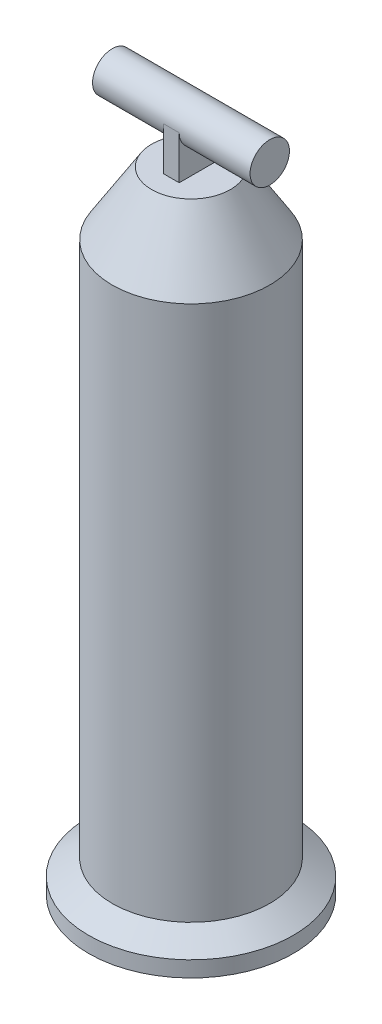
ISO-10303-21;
HEADER;
FILE_DESCRIPTION(('STEP AP214'),'2;1');
FILE_NAME('part.step','',(''),(''),'','','');
FILE_SCHEMA(('AUTOMOTIVE_DESIGN { 1 0 10303 214 1 1 1 1 }'));
ENDSEC;
DATA;
#1=APPLICATION_CONTEXT('core data for automotive mechanical design processes');
#2=APPLICATION_PROTOCOL_DEFINITION('international standard','automotive_design',2000,#1);
#3=PRODUCT_CONTEXT('',#1,'mechanical');
#4=PRODUCT('Part','Part','',(#3));
#5=PRODUCT_RELATED_PRODUCT_CATEGORY('part','',(#4));
#6=PRODUCT_DEFINITION_FORMATION('','',#4);
#7=PRODUCT_DEFINITION_CONTEXT('part definition',#1,'design');
#8=PRODUCT_DEFINITION('design','',#6,#7);
#9=PRODUCT_DEFINITION_SHAPE('','',#8);
#10=(LENGTH_UNIT() NAMED_UNIT(*) SI_UNIT(.MILLI.,.METRE.));
#11=(NAMED_UNIT(*) PLANE_ANGLE_UNIT() SI_UNIT($,.RADIAN.));
#12=(NAMED_UNIT(*) SI_UNIT($,.STERADIAN.) SOLID_ANGLE_UNIT());
#13=UNCERTAINTY_MEASURE_WITH_UNIT(LENGTH_MEASURE(1.E-05),#10,'distance_accuracy_value','');
#14=(GEOMETRIC_REPRESENTATION_CONTEXT(3) GLOBAL_UNCERTAINTY_ASSIGNED_CONTEXT((#13)) GLOBAL_UNIT_ASSIGNED_CONTEXT((#10,
#11,#12)) REPRESENTATION_CONTEXT('',''));
#15=CARTESIAN_POINT('',(0.,0.,0.));
#16=DIRECTION('',(0.,0.,1.));
#17=DIRECTION('',(1.,0.,0.));
#18=AXIS2_PLACEMENT_3D('',#15,#16,#17);
#19=CARTESIAN_POINT('',(-1.,88.,2.5));
#20=DIRECTION('',(1.,0.,0.));
#21=DIRECTION('',(0.,0.,-1.));
#22=AXIS2_PLACEMENT_3D('',#19,#20,#21);
#23=PLANE('',#22);
#24=DIRECTION('',(0.,-1.,0.));
#25=VECTOR('',#24,1.);
#26=CARTESIAN_POINT('',(-1.,88.,2.5));
#27=LINE('',#26,#25);
#28=CARTESIAN_POINT('',(-1.,85.5,2.5));
#29=VERTEX_POINT('',#28);
#30=CARTESIAN_POINT('',(-1.,80.,2.5));
#31=VERTEX_POINT('',#30);
#32=EDGE_CURVE('E98',#29,#31,#27,.T.);
#33=ORIENTED_EDGE('',*,*,#32,.F.);
#34=CARTESIAN_POINT('',(-1.,85.5,0.));
#35=DIRECTION('',(1.,0.,0.));
#36=DIRECTION('',(0.,0.,-1.));
#37=AXIS2_PLACEMENT_3D('',#34,#35,#36);
#38=CIRCLE('',#37,2.5);
#39=CARTESIAN_POINT('',(-1.,85.5,-2.5));
#40=VERTEX_POINT('',#39);
#41=EDGE_CURVE('E85',#29,#40,#38,.T.);
#42=ORIENTED_EDGE('',*,*,#41,.T.);
#43=DIRECTION('',(0.,-1.,0.));
#44=VECTOR('',#43,1.);
#45=CARTESIAN_POINT('',(-1.,88.,-2.5));
#46=LINE('',#45,#44);
#47=CARTESIAN_POINT('',(-1.,80.,-2.5));
#48=VERTEX_POINT('',#47);
#49=EDGE_CURVE('E65',#40,#48,#46,.T.);
#50=ORIENTED_EDGE('',*,*,#49,.T.);
#51=DIRECTION('',(0.,0.,1.));
#52=VECTOR('',#51,1.);
#53=CARTESIAN_POINT('',(-1.,80.,2.5));
#54=LINE('',#53,#52);
#55=EDGE_CURVE('E102',#48,#31,#54,.T.);
#56=ORIENTED_EDGE('',*,*,#55,.T.);
#57=EDGE_LOOP('',(#33,#42,#50,#56));
#58=FACE_BOUND('',#57,.T.);
#59=ADVANCED_FACE('F42',(#58),#23,.F.);
#60=CARTESIAN_POINT('',(1.,88.,-2.5));
#61=DIRECTION('',(-1.,0.,0.));
#62=DIRECTION('',(0.,0.,1.));
#63=AXIS2_PLACEMENT_3D('',#60,#61,#62);
#64=PLANE('',#63);
#65=DIRECTION('',(0.,-1.,0.));
#66=VECTOR('',#65,1.);
#67=CARTESIAN_POINT('',(1.,88.,-2.5));
#68=LINE('',#67,#66);
#69=CARTESIAN_POINT('',(1.,85.5,-2.5));
#70=VERTEX_POINT('',#69);
#71=CARTESIAN_POINT('',(1.,80.,-2.5));
#72=VERTEX_POINT('',#71);
#73=EDGE_CURVE('E57',#70,#72,#68,.T.);
#74=ORIENTED_EDGE('',*,*,#73,.F.);
#75=CARTESIAN_POINT('',(1.,85.5,0.));
#76=DIRECTION('',(-1.,0.,0.));
#77=DIRECTION('',(0.,0.,1.));
#78=AXIS2_PLACEMENT_3D('',#75,#76,#77);
#79=CIRCLE('',#78,2.5);
#80=CARTESIAN_POINT('',(1.,85.5,2.5));
#81=VERTEX_POINT('',#80);
#82=EDGE_CURVE('E93',#70,#81,#79,.T.);
#83=ORIENTED_EDGE('',*,*,#82,.T.);
#84=DIRECTION('',(0.,-1.,0.));
#85=VECTOR('',#84,1.);
#86=CARTESIAN_POINT('',(1.,88.,2.5));
#87=LINE('',#86,#85);
#88=CARTESIAN_POINT('',(1.,80.,2.5));
#89=VERTEX_POINT('',#88);
#90=EDGE_CURVE('E99',#81,#89,#87,.T.);
#91=ORIENTED_EDGE('',*,*,#90,.T.);
#92=DIRECTION('',(0.,0.,-1.));
#93=VECTOR('',#92,1.);
#94=CARTESIAN_POINT('',(1.,80.,-2.5));
#95=LINE('',#94,#93);
#96=EDGE_CURVE('E311',#89,#72,#95,.T.);
#97=ORIENTED_EDGE('',*,*,#96,.T.);
#98=EDGE_LOOP('',(#74,#83,#91,#97));
#99=FACE_BOUND('',#98,.T.);
#100=ADVANCED_FACE('F141',(#99),#64,.F.);
#101=CARTESIAN_POINT('',(-1.,88.,-2.5));
#102=DIRECTION('',(0.,0.,1.));
#103=DIRECTION('',(1.,0.,0.));
#104=AXIS2_PLACEMENT_3D('',#101,#102,#103);
#105=PLANE('',#104);
#106=DIRECTION('',(-1.,0.,0.));
#107=VECTOR('',#106,1.);
#108=CARTESIAN_POINT('',(13.,85.5,-2.5));
#109=LINE('',#108,#107);
#110=EDGE_CURVE('E91',#70,#40,#109,.T.);
#111=ORIENTED_EDGE('',*,*,#110,.F.);
#112=ORIENTED_EDGE('',*,*,#73,.T.);
#113=DIRECTION('',(-1.,0.,0.));
#114=VECTOR('',#113,1.);
#115=CARTESIAN_POINT('',(-1.,80.,-2.5));
#116=LINE('',#115,#114);
#117=EDGE_CURVE('E313',#72,#48,#116,.T.);
#118=ORIENTED_EDGE('',*,*,#117,.T.);
#119=ORIENTED_EDGE('',*,*,#49,.F.);
#120=EDGE_LOOP('',(#111,#112,#118,#119));
#121=FACE_BOUND('',#120,.T.);
#122=ADVANCED_FACE('F146',(#121),#105,.F.);
#123=CARTESIAN_POINT('',(0.,80.,5.));
#124=DIRECTION('',(0.,1.,0.));
#125=DIRECTION('',(0.,0.,1.));
#126=AXIS2_PLACEMENT_3D('',#123,#124,#125);
#127=PLANE('',#126);
#128=CARTESIAN_POINT('',(0.,80.,0.));
#129=DIRECTION('',(0.,1.,0.));
#130=DIRECTION('',(0.,0.,1.));
#131=AXIS2_PLACEMENT_3D('',#128,#129,#130);
#132=CIRCLE('',#131,5.);
#133=CARTESIAN_POINT('',(0.,80.,5.));
#134=VERTEX_POINT('',#133);
#135=EDGE_CURVE('E114',#134,#134,#132,.T.);
#136=ORIENTED_EDGE('',*,*,#135,.T.);
#137=EDGE_LOOP('',(#136));
#138=FACE_BOUND('',#137,.T.);
#139=DIRECTION('',(1.,0.,0.));
#140=VECTOR('',#139,1.);
#141=CARTESIAN_POINT('',(1.,80.,2.5));
#142=LINE('',#141,#140);
#143=EDGE_CURVE('E309',#31,#89,#142,.T.);
#144=ORIENTED_EDGE('',*,*,#143,.F.);
#145=ORIENTED_EDGE('',*,*,#55,.F.);
#146=ORIENTED_EDGE('',*,*,#117,.F.);
#147=ORIENTED_EDGE('',*,*,#96,.F.);
#148=EDGE_LOOP('',(#144,#145,#146,#147));
#149=FACE_BOUND('',#148,.T.);
#150=ADVANCED_FACE('F159',(#138,#149),#127,.T.);
#151=CARTESIAN_POINT('',(0.,4.,0.));
#152=DIRECTION('',(0.,-1.,0.));
#153=DIRECTION('',(0.,0.,-1.));
#154=AXIS2_PLACEMENT_3D('',#151,#152,#153);
#155=CONICAL_SURFACE('',#154,9.99999999999999,0.982793723247328);
#156=CARTESIAN_POINT('',(0.,2.,0.));
#157=DIRECTION('',(0.,1.,0.));
#158=DIRECTION('',(0.,0.,1.));
#159=AXIS2_PLACEMENT_3D('',#156,#157,#158);
#160=CIRCLE('',#159,13.);
#161=CARTESIAN_POINT('',(0.,2.,13.));
#162=VERTEX_POINT('',#161);
#163=EDGE_CURVE('E11',#162,#162,#160,.T.);
#164=ORIENTED_EDGE('',*,*,#163,.T.);
#165=EDGE_LOOP('',(#164));
#166=FACE_BOUND('',#165,.T.);
#167=CARTESIAN_POINT('',(0.,4.,0.));
#168=DIRECTION('',(0.,1.,0.));
#169=DIRECTION('',(0.,0.,1.));
#170=AXIS2_PLACEMENT_3D('',#167,#168,#169);
#171=CIRCLE('',#170,9.99999999999999);
#172=CARTESIAN_POINT('',(0.,4.,9.99999999999999));
#173=VERTEX_POINT('',#172);
#174=EDGE_CURVE('E104',#173,#173,#171,.T.);
#175=ORIENTED_EDGE('',*,*,#174,.F.);
#176=EDGE_LOOP('',(#175));
#177=FACE_BOUND('',#176,.T.);
#178=ADVANCED_FACE('F44',(#166,#177),#155,.T.);
#179=CARTESIAN_POINT('',(0.,80.,0.));
#180=DIRECTION('',(0.,1.,0.));
#181=DIRECTION('',(0.,0.,1.));
#182=AXIS2_PLACEMENT_3D('',#179,#180,#181);
#183=CYLINDRICAL_SURFACE('',#182,13.);
#184=CARTESIAN_POINT('',(0.,0.,0.));
#185=DIRECTION('',(0.,1.,0.));
#186=DIRECTION('',(0.,0.,1.));
#187=AXIS2_PLACEMENT_3D('',#184,#185,#186);
#188=CIRCLE('',#187,13.);
#189=CARTESIAN_POINT('',(0.,0.,13.));
#190=VERTEX_POINT('',#189);
#191=EDGE_CURVE('E50',#190,#190,#188,.T.);
#192=ORIENTED_EDGE('',*,*,#191,.T.);
#193=EDGE_LOOP('',(#192));
#194=FACE_BOUND('',#193,.T.);
#195=ORIENTED_EDGE('',*,*,#163,.F.);
#196=EDGE_LOOP('',(#195));
#197=FACE_BOUND('',#196,.T.);
#198=ADVANCED_FACE('F125',(#194,#197),#183,.T.);
#199=CARTESIAN_POINT('',(0.,0.,13.));
#200=DIRECTION('',(0.,-1.,0.));
#201=DIRECTION('',(0.,0.,-1.));
#202=AXIS2_PLACEMENT_3D('',#199,#200,#201);
#203=PLANE('',#202);
#204=CARTESIAN_POINT('',(0.,0.,0.));
#205=DIRECTION('',(0.,1.,0.));
#206=DIRECTION('',(0.,0.,1.));
#207=AXIS2_PLACEMENT_3D('',#204,#205,#206);
#208=CIRCLE('',#207,7.99999999999999);
#209=CARTESIAN_POINT('',(0.,0.,7.99999999999999));
#210=VERTEX_POINT('',#209);
#211=EDGE_CURVE('E120',#210,#210,#208,.T.);
#212=ORIENTED_EDGE('',*,*,#211,.T.);
#213=EDGE_LOOP('',(#212));
#214=FACE_BOUND('',#213,.T.);
#215=ORIENTED_EDGE('',*,*,#191,.F.);
#216=EDGE_LOOP('',(#215));
#217=FACE_BOUND('',#216,.T.);
#218=ADVANCED_FACE('F128',(#214,#217),#203,.T.);
#219=CARTESIAN_POINT('',(0.,80.,0.));
#220=DIRECTION('',(0.,1.,0.));
#221=DIRECTION('',(0.,0.,1.));
#222=AXIS2_PLACEMENT_3D('',#219,#220,#221);
#223=CYLINDRICAL_SURFACE('',#222,7.99999999999999);
#224=CARTESIAN_POINT('',(0.,71.4264075471774,0.));
#225=DIRECTION('',(0.,1.,0.));
#226=DIRECTION('',(0.,0.,1.));
#227=AXIS2_PLACEMENT_3D('',#224,#225,#226);
#228=CIRCLE('',#227,7.99999999999999);
#229=CARTESIAN_POINT('',(0.,71.4264075471774,7.99999999999999));
#230=VERTEX_POINT('',#229);
#231=EDGE_CURVE('E117',#230,#230,#228,.T.);
#232=ORIENTED_EDGE('',*,*,#231,.T.);
#233=EDGE_LOOP('',(#232));
#234=FACE_BOUND('',#233,.T.);
#235=ORIENTED_EDGE('',*,*,#211,.F.);
#236=EDGE_LOOP('',(#235));
#237=FACE_BOUND('',#236,.T.);
#238=ADVANCED_FACE('F130',(#234,#237),#223,.F.);
#239=CARTESIAN_POINT('',(0.,71.4264075471774,7.99999999999999));
#240=DIRECTION('',(0.,-1.,0.));
#241=DIRECTION('',(0.,0.,-1.));
#242=AXIS2_PLACEMENT_3D('',#239,#240,#241);
#243=PLANE('',#242);
#244=ORIENTED_EDGE('',*,*,#231,.F.);
#245=EDGE_LOOP('',(#244));
#246=FACE_BOUND('',#245,.T.);
#247=ADVANCED_FACE('F137',(#246),#243,.T.);
#248=CARTESIAN_POINT('',(0.,80.,0.));
#249=DIRECTION('',(0.,-1.,0.));
#250=DIRECTION('',(0.,0.,-1.));
#251=AXIS2_PLACEMENT_3D('',#248,#249,#250);
#252=CONICAL_SURFACE('',#251,5.,0.558599315343562);
#253=CARTESIAN_POINT('',(0.,72.,0.));
#254=DIRECTION('',(0.,1.,0.));
#255=DIRECTION('',(0.,0.,1.));
#256=AXIS2_PLACEMENT_3D('',#253,#254,#255);
#257=CIRCLE('',#256,9.99999999999999);
#258=CARTESIAN_POINT('',(0.,72.,9.99999999999999));
#259=VERTEX_POINT('',#258);
#260=EDGE_CURVE('E107',#259,#259,#257,.T.);
#261=ORIENTED_EDGE('',*,*,#260,.T.);
#262=EDGE_LOOP('',(#261));
#263=FACE_BOUND('',#262,.T.);
#264=ORIENTED_EDGE('',*,*,#135,.F.);
#265=EDGE_LOOP('',(#264));
#266=FACE_BOUND('',#265,.T.);
#267=ADVANCED_FACE('F154',(#263,#266),#252,.T.);
#268=CARTESIAN_POINT('',(0.,80.,0.));
#269=DIRECTION('',(0.,1.,0.));
#270=DIRECTION('',(0.,0.,1.));
#271=AXIS2_PLACEMENT_3D('',#268,#269,#270);
#272=CYLINDRICAL_SURFACE('',#271,9.99999999999999);
#273=ORIENTED_EDGE('',*,*,#174,.T.);
#274=EDGE_LOOP('',(#273));
#275=FACE_BOUND('',#274,.T.);
#276=ORIENTED_EDGE('',*,*,#260,.F.);
#277=EDGE_LOOP('',(#276));
#278=FACE_BOUND('',#277,.T.);
#279=ADVANCED_FACE('F151',(#275,#278),#272,.T.);
#280=CARTESIAN_POINT('',(1.,88.,2.5));
#281=DIRECTION('',(0.,0.,-1.));
#282=DIRECTION('',(-1.,0.,0.));
#283=AXIS2_PLACEMENT_3D('',#280,#281,#282);
#284=PLANE('',#283);
#285=ORIENTED_EDGE('',*,*,#90,.F.);
#286=DIRECTION('',(-1.,0.,0.));
#287=VECTOR('',#286,1.);
#288=CARTESIAN_POINT('',(13.,85.5,2.5));
#289=LINE('',#288,#287);
#290=EDGE_CURVE('E89',#81,#29,#289,.T.);
#291=ORIENTED_EDGE('',*,*,#290,.T.);
#292=ORIENTED_EDGE('',*,*,#32,.T.);
#293=ORIENTED_EDGE('',*,*,#143,.T.);
#294=EDGE_LOOP('',(#285,#291,#292,#293));
#295=FACE_BOUND('',#294,.T.);
#296=ADVANCED_FACE('F96',(#295),#284,.F.);
#297=CARTESIAN_POINT('',(13.,85.5,0.));
#298=DIRECTION('',(-1.,0.,0.));
#299=DIRECTION('',(0.,0.,1.));
#300=AXIS2_PLACEMENT_3D('',#297,#298,#299);
#301=CYLINDRICAL_SURFACE('',#300,2.5);
#302=ORIENTED_EDGE('',*,*,#110,.T.);
#303=ORIENTED_EDGE('',*,*,#41,.F.);
#304=ORIENTED_EDGE('',*,*,#290,.F.);
#305=ORIENTED_EDGE('',*,*,#82,.F.);
#306=EDGE_LOOP('',(#302,#303,#304,#305));
#307=FACE_BOUND('',#306,.T.);
#308=CARTESIAN_POINT('',(10.,85.5,0.));
#309=DIRECTION('',(-1.,0.,0.));
#310=DIRECTION('',(0.,0.,1.));
#311=AXIS2_PLACEMENT_3D('',#308,#309,#310);
#312=CIRCLE('',#311,2.5);
#313=CARTESIAN_POINT('',(10.,85.5,2.5));
#314=VERTEX_POINT('',#313);
#315=EDGE_CURVE('E319',#314,#314,#312,.T.);
#316=ORIENTED_EDGE('',*,*,#315,.T.);
#317=EDGE_LOOP('',(#316));
#318=FACE_BOUND('',#317,.T.);
#319=CARTESIAN_POINT('',(-10.,85.5,0.));
#320=DIRECTION('',(-1.,0.,0.));
#321=DIRECTION('',(0.,0.,1.));
#322=AXIS2_PLACEMENT_3D('',#319,#320,#321);
#323=CIRCLE('',#322,2.5);
#324=CARTESIAN_POINT('',(-10.,85.5,2.5));
#325=VERTEX_POINT('',#324);
#326=EDGE_CURVE('E322',#325,#325,#323,.T.);
#327=ORIENTED_EDGE('',*,*,#326,.F.);
#328=EDGE_LOOP('',(#327));
#329=FACE_BOUND('',#328,.T.);
#330=ADVANCED_FACE('F87',(#307,#318,#329),#301,.T.);
#331=CARTESIAN_POINT('',(10.,0.,0.));
#332=DIRECTION('',(-1.,0.,0.));
#333=DIRECTION('',(0.,0.,1.));
#334=AXIS2_PLACEMENT_3D('',#331,#332,#333);
#335=PLANE('',#334);
#336=ORIENTED_EDGE('',*,*,#315,.F.);
#337=EDGE_LOOP('',(#336));
#338=FACE_BOUND('',#337,.T.);
#339=ADVANCED_FACE('F191',(#338),#335,.F.);
#340=CARTESIAN_POINT('',(-10.,0.,0.));
#341=DIRECTION('',(-1.,0.,0.));
#342=DIRECTION('',(0.,0.,1.));
#343=AXIS2_PLACEMENT_3D('',#340,#341,#342);
#344=PLANE('',#343);
#345=ORIENTED_EDGE('',*,*,#326,.T.);
#346=EDGE_LOOP('',(#345));
#347=FACE_BOUND('',#346,.T.);
#348=ADVANCED_FACE('F198',(#347),#344,.T.);
#349=CLOSED_SHELL('',(#59,#100,#122,#150,#178,#198,#218,#238,#247,#267,#279,#296,#330,#339,#348));
#350=MANIFOLD_SOLID_BREP('B2',#349);
#351=ADVANCED_BREP_SHAPE_REPRESENTATION('',(#18,#350),#14);
#352=SHAPE_DEFINITION_REPRESENTATION(#9,#351);
ENDSEC;
END-ISO-10303-21;
